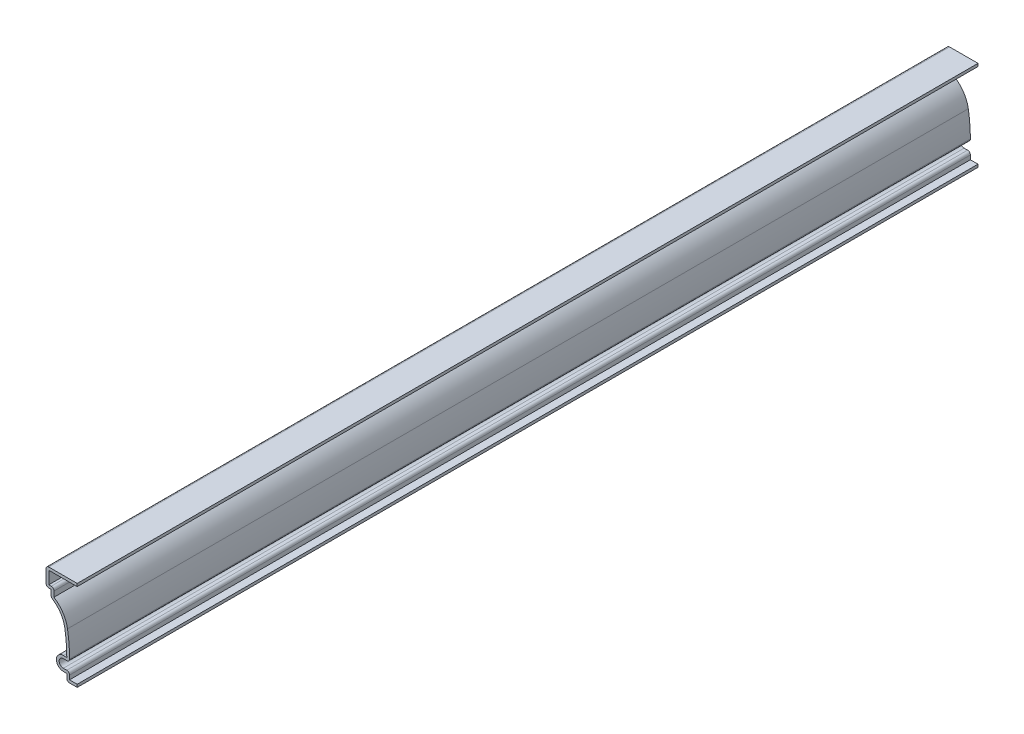
ISO-10303-21;
HEADER;
FILE_DESCRIPTION(('STEP AP214'),'2;1');
FILE_NAME('part.step','',(''),(''),'','','');
FILE_SCHEMA(('AUTOMOTIVE_DESIGN { 1 0 10303 214 1 1 1 1 }'));
ENDSEC;
DATA;
#1=APPLICATION_CONTEXT('core data for automotive mechanical design processes');
#2=APPLICATION_PROTOCOL_DEFINITION('international standard','automotive_design',2000,#1);
#3=PRODUCT_CONTEXT('',#1,'mechanical');
#4=PRODUCT('Part','Part','',(#3));
#5=PRODUCT_RELATED_PRODUCT_CATEGORY('part','',(#4));
#6=PRODUCT_DEFINITION_FORMATION('','',#4);
#7=PRODUCT_DEFINITION_CONTEXT('part definition',#1,'design');
#8=PRODUCT_DEFINITION('design','',#6,#7);
#9=PRODUCT_DEFINITION_SHAPE('','',#8);
#10=(LENGTH_UNIT() NAMED_UNIT(*) SI_UNIT(.MILLI.,.METRE.));
#11=(NAMED_UNIT(*) PLANE_ANGLE_UNIT() SI_UNIT($,.RADIAN.));
#12=(NAMED_UNIT(*) SI_UNIT($,.STERADIAN.) SOLID_ANGLE_UNIT());
#13=UNCERTAINTY_MEASURE_WITH_UNIT(LENGTH_MEASURE(1.E-05),#10,'distance_accuracy_value','');
#14=(GEOMETRIC_REPRESENTATION_CONTEXT(3) GLOBAL_UNCERTAINTY_ASSIGNED_CONTEXT((#13)) GLOBAL_UNIT_ASSIGNED_CONTEXT((#10,
#11,#12)) REPRESENTATION_CONTEXT('',''));
#15=CARTESIAN_POINT('',(0.,0.,0.));
#16=DIRECTION('',(0.,0.,1.));
#17=DIRECTION('',(1.,0.,0.));
#18=AXIS2_PLACEMENT_3D('',#15,#16,#17);
#19=CARTESIAN_POINT('',(0.,0.,-412.75));
#20=DIRECTION('',(0.,-1.,0.));
#21=DIRECTION('',(1.,0.,0.));
#22=AXIS2_PLACEMENT_3D('',#19,#20,#21);
#23=PLANE('',#22);
#24=DIRECTION('',(1.,0.,0.));
#25=VECTOR('',#24,1.);
#26=CARTESIAN_POINT('',(0.,0.,0.));
#27=LINE('',#26,#25);
#28=CARTESIAN_POINT('',(-3.4925,0.,0.));
#29=VERTEX_POINT('',#28);
#30=CARTESIAN_POINT('',(0.,0.,0.));
#31=VERTEX_POINT('',#30);
#32=EDGE_CURVE('E443',#29,#31,#27,.T.);
#33=ORIENTED_EDGE('',*,*,#32,.F.);
#34=DIRECTION('',(0.,0.,1.));
#35=VECTOR('',#34,1.);
#36=CARTESIAN_POINT('',(-3.4925,0.,-412.75));
#37=LINE('',#36,#35);
#38=CARTESIAN_POINT('',(-3.4925,0.,-412.75));
#39=VERTEX_POINT('',#38);
#40=EDGE_CURVE('E247',#29,#39,#37,.F.);
#41=ORIENTED_EDGE('',*,*,#40,.T.);
#42=DIRECTION('',(1.,0.,0.));
#43=VECTOR('',#42,1.);
#44=CARTESIAN_POINT('',(0.,0.,-412.75));
#45=LINE('',#44,#43);
#46=CARTESIAN_POINT('',(0.,0.,-412.75));
#47=VERTEX_POINT('',#46);
#48=EDGE_CURVE('E240',#39,#47,#45,.T.);
#49=ORIENTED_EDGE('',*,*,#48,.T.);
#50=DIRECTION('',(0.,0.,1.));
#51=VECTOR('',#50,1.);
#52=CARTESIAN_POINT('',(0.,0.,-412.75));
#53=LINE('',#52,#51);
#54=EDGE_CURVE('E244',#47,#31,#53,.T.);
#55=ORIENTED_EDGE('',*,*,#54,.T.);
#56=EDGE_LOOP('',(#33,#41,#49,#55));
#57=FACE_BOUND('',#56,.T.);
#58=ADVANCED_FACE('F35',(#57),#23,.T.);
#59=CARTESIAN_POINT('',(-4.7625,0.,-412.75));
#60=DIRECTION('',(-1.,0.,0.));
#61=DIRECTION('',(0.,0.,1.));
#62=AXIS2_PLACEMENT_3D('',#59,#60,#61);
#63=PLANE('',#62);
#64=DIRECTION('',(0.,-1.,0.));
#65=VECTOR('',#64,1.);
#66=CARTESIAN_POINT('',(-4.7625,0.,-412.75));
#67=LINE('',#66,#65);
#68=CARTESIAN_POINT('',(-4.7625,3.175,-412.75));
#69=VERTEX_POINT('',#68);
#70=CARTESIAN_POINT('',(-4.7625,1.27,-412.75));
#71=VERTEX_POINT('',#70);
#72=EDGE_CURVE('E264',#69,#71,#67,.T.);
#73=ORIENTED_EDGE('',*,*,#72,.T.);
#74=DIRECTION('',(0.,0.,1.));
#75=VECTOR('',#74,1.);
#76=CARTESIAN_POINT('',(-4.7625,1.27,-412.75));
#77=LINE('',#76,#75);
#78=CARTESIAN_POINT('',(-4.7625,1.27,0.));
#79=VERTEX_POINT('',#78);
#80=EDGE_CURVE('E273',#71,#79,#77,.T.);
#81=ORIENTED_EDGE('',*,*,#80,.T.);
#82=DIRECTION('',(0.,-1.,0.));
#83=VECTOR('',#82,1.);
#84=CARTESIAN_POINT('',(-4.7625,0.,0.));
#85=LINE('',#84,#83);
#86=CARTESIAN_POINT('',(-4.7625,3.175,0.));
#87=VERTEX_POINT('',#86);
#88=EDGE_CURVE('E250',#87,#79,#85,.T.);
#89=ORIENTED_EDGE('',*,*,#88,.F.);
#90=DIRECTION('',(0.,0.,1.));
#91=VECTOR('',#90,1.);
#92=CARTESIAN_POINT('',(-4.7625,3.175,-412.75));
#93=LINE('',#92,#91);
#94=EDGE_CURVE('E277',#69,#87,#93,.T.);
#95=ORIENTED_EDGE('',*,*,#94,.F.);
#96=EDGE_LOOP('',(#73,#81,#89,#95));
#97=FACE_BOUND('',#96,.T.);
#98=ADVANCED_FACE('F514',(#97),#63,.T.);
#99=CARTESIAN_POINT('',(-4.7625,3.175,-412.75));
#100=DIRECTION('',(0.,-1.,0.));
#101=DIRECTION('',(0.,0.,-1.));
#102=AXIS2_PLACEMENT_3D('',#99,#100,#101);
#103=PLANE('',#102);
#104=DIRECTION('',(1.,0.,0.));
#105=VECTOR('',#104,1.);
#106=CARTESIAN_POINT('',(-4.7625,3.175,0.));
#107=LINE('',#106,#105);
#108=CARTESIAN_POINT('',(-6.35,3.175,0.));
#109=VERTEX_POINT('',#108);
#110=EDGE_CURVE('E394',#109,#87,#107,.T.);
#111=ORIENTED_EDGE('',*,*,#110,.F.);
#112=DIRECTION('',(0.,0.,1.));
#113=VECTOR('',#112,1.);
#114=CARTESIAN_POINT('',(-6.35,3.175,-412.75));
#115=LINE('',#114,#113);
#116=CARTESIAN_POINT('',(-6.35,3.175,-412.75));
#117=VERTEX_POINT('',#116);
#118=EDGE_CURVE('E399',#117,#109,#115,.T.);
#119=ORIENTED_EDGE('',*,*,#118,.F.);
#120=DIRECTION('',(1.,0.,0.));
#121=VECTOR('',#120,1.);
#122=CARTESIAN_POINT('',(-4.7625,3.175,-412.75));
#123=LINE('',#122,#121);
#124=EDGE_CURVE('E269',#117,#69,#123,.T.);
#125=ORIENTED_EDGE('',*,*,#124,.T.);
#126=ORIENTED_EDGE('',*,*,#94,.T.);
#127=EDGE_LOOP('',(#111,#119,#125,#126));
#128=FACE_BOUND('',#127,.T.);
#129=ADVANCED_FACE('F518',(#128),#103,.T.);
#130=CARTESIAN_POINT('',(-6.35,6.35,-412.75));
#131=DIRECTION('',(0.,0.,1.));
#132=DIRECTION('',(1.,0.,0.));
#133=AXIS2_PLACEMENT_3D('',#130,#131,#132);
#134=CYLINDRICAL_SURFACE('',#133,3.175);
#135=CARTESIAN_POINT('',(-6.35,6.35,0.));
#136=DIRECTION('',(0.,0.,1.));
#137=DIRECTION('',(-1.,0.,0.));
#138=AXIS2_PLACEMENT_3D('',#135,#136,#137);
#139=CIRCLE('',#138,3.175);
#140=CARTESIAN_POINT('',(-6.35,9.525,0.));
#141=VERTEX_POINT('',#140);
#142=EDGE_CURVE('E391',#141,#109,#139,.T.);
#143=ORIENTED_EDGE('',*,*,#142,.F.);
#144=DIRECTION('',(0.,0.,1.));
#145=VECTOR('',#144,1.);
#146=CARTESIAN_POINT('',(-6.35,9.525,-412.75));
#147=LINE('',#146,#145);
#148=CARTESIAN_POINT('',(-6.35,9.525,-412.75));
#149=VERTEX_POINT('',#148);
#150=EDGE_CURVE('E401',#149,#141,#147,.T.);
#151=ORIENTED_EDGE('',*,*,#150,.F.);
#152=CARTESIAN_POINT('',(-6.35,6.35,-412.75));
#153=DIRECTION('',(0.,0.,1.));
#154=DIRECTION('',(-1.,0.,0.));
#155=AXIS2_PLACEMENT_3D('',#152,#153,#154);
#156=CIRCLE('',#155,3.175);
#157=EDGE_CURVE('E504',#149,#117,#156,.T.);
#158=ORIENTED_EDGE('',*,*,#157,.T.);
#159=ORIENTED_EDGE('',*,*,#118,.T.);
#160=EDGE_LOOP('',(#143,#151,#158,#159));
#161=FACE_BOUND('',#160,.T.);
#162=ADVANCED_FACE('F523',(#161),#134,.T.);
#163=CARTESIAN_POINT('',(-6.35,9.525,-412.75));
#164=DIRECTION('',(0.,1.,0.));
#165=DIRECTION('',(-1.,0.,0.));
#166=AXIS2_PLACEMENT_3D('',#163,#164,#165);
#167=PLANE('',#166);
#168=DIRECTION('',(-1.,0.,0.));
#169=VECTOR('',#168,1.);
#170=CARTESIAN_POINT('',(-6.35,9.525,0.));
#171=LINE('',#170,#169);
#172=CARTESIAN_POINT('',(-4.7625,9.525,0.));
#173=VERTEX_POINT('',#172);
#174=EDGE_CURVE('E388',#173,#141,#171,.T.);
#175=ORIENTED_EDGE('',*,*,#174,.F.);
#176=DIRECTION('',(0.,0.,1.));
#177=VECTOR('',#176,1.);
#178=CARTESIAN_POINT('',(-4.7625,9.525,-412.75));
#179=LINE('',#178,#177);
#180=CARTESIAN_POINT('',(-4.7625,9.525,-412.75));
#181=VERTEX_POINT('',#180);
#182=EDGE_CURVE('E403',#181,#173,#179,.T.);
#183=ORIENTED_EDGE('',*,*,#182,.F.);
#184=DIRECTION('',(-1.,0.,0.));
#185=VECTOR('',#184,1.);
#186=CARTESIAN_POINT('',(-6.35,9.525,-412.75));
#187=LINE('',#186,#185);
#188=EDGE_CURVE('E501',#181,#149,#187,.T.);
#189=ORIENTED_EDGE('',*,*,#188,.T.);
#190=ORIENTED_EDGE('',*,*,#150,.T.);
#191=EDGE_LOOP('',(#175,#183,#189,#190));
#192=FACE_BOUND('',#191,.T.);
#193=ADVANCED_FACE('F526',(#192),#167,.T.);
#194=CARTESIAN_POINT('',(-73.81875,9.525,-412.75));
#195=DIRECTION('',(0.,0.,1.));
#196=DIRECTION('',(1.,0.,0.));
#197=AXIS2_PLACEMENT_3D('',#194,#195,#196);
#198=CYLINDRICAL_SURFACE('',#197,69.05625);
#199=CARTESIAN_POINT('',(-73.81875,9.525,0.));
#200=DIRECTION('',(0.,0.,-1.));
#201=DIRECTION('',(-1.,0.,0.));
#202=AXIS2_PLACEMENT_3D('',#199,#200,#201);
#203=CIRCLE('',#202,69.05625);
#204=CARTESIAN_POINT('',(-5.69345136267402,20.8258561462241,0.));
#205=VERTEX_POINT('',#204);
#206=EDGE_CURVE('E385',#205,#173,#203,.T.);
#207=ORIENTED_EDGE('',*,*,#206,.F.);
#208=DIRECTION('',(0.,0.,1.));
#209=VECTOR('',#208,1.);
#210=CARTESIAN_POINT('',(-5.69345136267402,20.8258561462241,-412.75));
#211=LINE('',#210,#209);
#212=CARTESIAN_POINT('',(-5.69345136267402,20.8258561462241,-412.75));
#213=VERTEX_POINT('',#212);
#214=EDGE_CURVE('E405',#213,#205,#211,.T.);
#215=ORIENTED_EDGE('',*,*,#214,.F.);
#216=CARTESIAN_POINT('',(-73.81875,9.525,-412.75));
#217=DIRECTION('',(0.,0.,-1.));
#218=DIRECTION('',(-1.,0.,0.));
#219=AXIS2_PLACEMENT_3D('',#216,#217,#218);
#220=CIRCLE('',#219,69.05625);
#221=EDGE_CURVE('E498',#213,#181,#220,.T.);
#222=ORIENTED_EDGE('',*,*,#221,.T.);
#223=ORIENTED_EDGE('',*,*,#182,.T.);
#224=EDGE_LOOP('',(#207,#215,#222,#223));
#225=FACE_BOUND('',#224,.T.);
#226=ADVANCED_FACE('F532',(#225),#198,.F.);
#227=CARTESIAN_POINT('',(-18.222241916665,18.7475377745047,-412.75));
#228=DIRECTION('',(0.,0.,1.));
#229=DIRECTION('',(1.,0.,0.));
#230=AXIS2_PLACEMENT_3D('',#227,#228,#229);
#231=CYLINDRICAL_SURFACE('',#230,12.7);
#232=CARTESIAN_POINT('',(-18.222241916665,18.7475377745047,0.));
#233=DIRECTION('',(0.,0.,-1.));
#234=DIRECTION('',(-1.,0.,0.));
#235=AXIS2_PLACEMENT_3D('',#232,#233,#234);
#236=CIRCLE('',#235,12.7);
#237=CARTESIAN_POINT('',(-11.3258856287877,29.4119772792633,0.));
#238=VERTEX_POINT('',#237);
#239=EDGE_CURVE('E383',#238,#205,#236,.T.);
#240=ORIENTED_EDGE('',*,*,#239,.F.);
#241=DIRECTION('',(0.,0.,1.));
#242=VECTOR('',#241,1.);
#243=CARTESIAN_POINT('',(-11.3258856287877,29.4119772792633,-412.75));
#244=LINE('',#243,#242);
#245=CARTESIAN_POINT('',(-11.3258856287877,29.4119772792633,-412.75));
#246=VERTEX_POINT('',#245);
#247=EDGE_CURVE('E317',#238,#246,#244,.F.);
#248=ORIENTED_EDGE('',*,*,#247,.T.);
#249=CARTESIAN_POINT('',(-18.222241916665,18.7475377745047,-412.75));
#250=DIRECTION('',(0.,0.,-1.));
#251=DIRECTION('',(-1.,0.,0.));
#252=AXIS2_PLACEMENT_3D('',#249,#250,#251);
#253=CIRCLE('',#252,12.7);
#254=EDGE_CURVE('E496',#246,#213,#253,.T.);
#255=ORIENTED_EDGE('',*,*,#254,.T.);
#256=ORIENTED_EDGE('',*,*,#214,.T.);
#257=EDGE_LOOP('',(#240,#248,#255,#256));
#258=FACE_BOUND('',#257,.T.);
#259=ADVANCED_FACE('F535',(#258),#231,.F.);
#260=CARTESIAN_POINT('',(-11.90625,32.940625,-412.75));
#261=DIRECTION('',(-1.,0.,0.));
#262=DIRECTION('',(0.,0.,1.));
#263=AXIS2_PLACEMENT_3D('',#260,#261,#262);
#264=PLANE('',#263);
#265=DIRECTION('',(0.,-1.,0.));
#266=VECTOR('',#265,1.);
#267=CARTESIAN_POINT('',(-11.90625,32.940625,-412.75));
#268=LINE('',#267,#266);
#269=CARTESIAN_POINT('',(-11.90625,32.940625,-412.75));
#270=VERTEX_POINT('',#269);
#271=CARTESIAN_POINT('',(-11.90625,30.4784212297392,-412.75));
#272=VERTEX_POINT('',#271);
#273=EDGE_CURVE('E493',#270,#272,#268,.T.);
#274=ORIENTED_EDGE('',*,*,#273,.T.);
#275=DIRECTION('',(0.,0.,1.));
#276=VECTOR('',#275,1.);
#277=CARTESIAN_POINT('',(-11.90625,30.4784212297392,-412.75));
#278=LINE('',#277,#276);
#279=CARTESIAN_POINT('',(-11.90625,30.4784212297392,0.));
#280=VERTEX_POINT('',#279);
#281=EDGE_CURVE('E314',#272,#280,#278,.T.);
#282=ORIENTED_EDGE('',*,*,#281,.T.);
#283=DIRECTION('',(0.,-1.,0.));
#284=VECTOR('',#283,1.);
#285=CARTESIAN_POINT('',(-11.90625,32.940625,0.));
#286=LINE('',#285,#284);
#287=CARTESIAN_POINT('',(-11.90625,32.940625,0.));
#288=VERTEX_POINT('',#287);
#289=EDGE_CURVE('E380',#288,#280,#286,.T.);
#290=ORIENTED_EDGE('',*,*,#289,.F.);
#291=DIRECTION('',(0.,0.,1.));
#292=VECTOR('',#291,1.);
#293=CARTESIAN_POINT('',(-11.90625,32.940625,-412.75));
#294=LINE('',#293,#292);
#295=EDGE_CURVE('E408',#270,#288,#294,.T.);
#296=ORIENTED_EDGE('',*,*,#295,.F.);
#297=EDGE_LOOP('',(#274,#282,#290,#296));
#298=FACE_BOUND('',#297,.T.);
#299=ADVANCED_FACE('F544',(#298),#264,.T.);
#300=CARTESIAN_POINT('',(-14.2875,32.940625,-412.75));
#301=DIRECTION('',(0.,-1.,0.));
#302=DIRECTION('',(1.,0.,0.));
#303=AXIS2_PLACEMENT_3D('',#300,#301,#302);
#304=PLANE('',#303);
#305=DIRECTION('',(1.,0.,0.));
#306=VECTOR('',#305,1.);
#307=CARTESIAN_POINT('',(-14.2875,32.940625,0.));
#308=LINE('',#307,#306);
#309=CARTESIAN_POINT('',(-13.0175,32.940625,0.));
#310=VERTEX_POINT('',#309);
#311=EDGE_CURVE('E378',#310,#288,#308,.T.);
#312=ORIENTED_EDGE('',*,*,#311,.F.);
#313=DIRECTION('',(0.,0.,1.));
#314=VECTOR('',#313,1.);
#315=CARTESIAN_POINT('',(-13.0175,32.940625,-412.75));
#316=LINE('',#315,#314);
#317=CARTESIAN_POINT('',(-13.0175,32.940625,-412.75));
#318=VERTEX_POINT('',#317);
#319=EDGE_CURVE('E324',#310,#318,#316,.F.);
#320=ORIENTED_EDGE('',*,*,#319,.T.);
#321=DIRECTION('',(1.,0.,0.));
#322=VECTOR('',#321,1.);
#323=CARTESIAN_POINT('',(-14.2875,32.940625,-412.75));
#324=LINE('',#323,#322);
#325=EDGE_CURVE('E491',#318,#270,#324,.T.);
#326=ORIENTED_EDGE('',*,*,#325,.T.);
#327=ORIENTED_EDGE('',*,*,#295,.T.);
#328=EDGE_LOOP('',(#312,#320,#326,#327));
#329=FACE_BOUND('',#328,.T.);
#330=ADVANCED_FACE('F549',(#329),#304,.T.);
#331=CARTESIAN_POINT('',(-14.2875,41.275,-412.75));
#332=DIRECTION('',(-1.,0.,0.));
#333=DIRECTION('',(0.,-1.,0.));
#334=AXIS2_PLACEMENT_3D('',#331,#332,#333);
#335=PLANE('',#334);
#336=DIRECTION('',(0.,-1.,0.));
#337=VECTOR('',#336,1.);
#338=CARTESIAN_POINT('',(-14.2875,41.275,-412.75));
#339=LINE('',#338,#337);
#340=CARTESIAN_POINT('',(-14.2875,40.005,-412.75));
#341=VERTEX_POINT('',#340);
#342=CARTESIAN_POINT('',(-14.2875,34.210625,-412.75));
#343=VERTEX_POINT('',#342);
#344=EDGE_CURVE('E488',#341,#343,#339,.T.);
#345=ORIENTED_EDGE('',*,*,#344,.T.);
#346=DIRECTION('',(0.,0.,1.));
#347=VECTOR('',#346,1.);
#348=CARTESIAN_POINT('',(-14.2875,34.210625,-412.75));
#349=LINE('',#348,#347);
#350=CARTESIAN_POINT('',(-14.2875,34.210625,0.));
#351=VERTEX_POINT('',#350);
#352=EDGE_CURVE('E321',#343,#351,#349,.T.);
#353=ORIENTED_EDGE('',*,*,#352,.T.);
#354=DIRECTION('',(0.,-1.,0.));
#355=VECTOR('',#354,1.);
#356=CARTESIAN_POINT('',(-14.2875,41.275,0.));
#357=LINE('',#356,#355);
#358=CARTESIAN_POINT('',(-14.2875,40.005,0.));
#359=VERTEX_POINT('',#358);
#360=EDGE_CURVE('E375',#359,#351,#357,.T.);
#361=ORIENTED_EDGE('',*,*,#360,.F.);
#362=DIRECTION('',(0.,0.,1.));
#363=VECTOR('',#362,1.);
#364=CARTESIAN_POINT('',(-14.2875,40.005,-412.75));
#365=LINE('',#364,#363);
#366=EDGE_CURVE('E319',#359,#341,#365,.F.);
#367=ORIENTED_EDGE('',*,*,#366,.T.);
#368=EDGE_LOOP('',(#345,#353,#361,#367));
#369=FACE_BOUND('',#368,.T.);
#370=ADVANCED_FACE('F558',(#369),#335,.T.);
#371=CARTESIAN_POINT('',(0.,41.275,-412.75));
#372=DIRECTION('',(0.,1.,0.));
#373=DIRECTION('',(0.,0.,1.));
#374=AXIS2_PLACEMENT_3D('',#371,#372,#373);
#375=PLANE('',#374);
#376=DIRECTION('',(-1.,0.,0.));
#377=VECTOR('',#376,1.);
#378=CARTESIAN_POINT('',(0.,41.275,-412.75));
#379=LINE('',#378,#377);
#380=CARTESIAN_POINT('',(0.,41.275,-412.75));
#381=VERTEX_POINT('',#380);
#382=CARTESIAN_POINT('',(-13.0175,41.275,-412.75));
#383=VERTEX_POINT('',#382);
#384=EDGE_CURVE('E485',#381,#383,#379,.T.);
#385=ORIENTED_EDGE('',*,*,#384,.T.);
#386=DIRECTION('',(0.,0.,1.));
#387=VECTOR('',#386,1.);
#388=CARTESIAN_POINT('',(-13.0175,41.275,-412.75));
#389=LINE('',#388,#387);
#390=CARTESIAN_POINT('',(-13.0175,41.275,0.));
#391=VERTEX_POINT('',#390);
#392=EDGE_CURVE('E11',#383,#391,#389,.T.);
#393=ORIENTED_EDGE('',*,*,#392,.T.);
#394=DIRECTION('',(-1.,0.,0.));
#395=VECTOR('',#394,1.);
#396=CARTESIAN_POINT('',(0.,41.275,0.));
#397=LINE('',#396,#395);
#398=CARTESIAN_POINT('',(0.,41.275,0.));
#399=VERTEX_POINT('',#398);
#400=EDGE_CURVE('E372',#399,#391,#397,.T.);
#401=ORIENTED_EDGE('',*,*,#400,.F.);
#402=DIRECTION('',(0.,0.,1.));
#403=VECTOR('',#402,1.);
#404=CARTESIAN_POINT('',(0.,41.275,-412.75));
#405=LINE('',#404,#403);
#406=EDGE_CURVE('E411',#381,#399,#405,.T.);
#407=ORIENTED_EDGE('',*,*,#406,.F.);
#408=EDGE_LOOP('',(#385,#393,#401,#407));
#409=FACE_BOUND('',#408,.T.);
#410=ADVANCED_FACE('F566',(#409),#375,.T.);
#411=CARTESIAN_POINT('',(0.,41.275,-412.75));
#412=DIRECTION('',(-1.,0.,0.));
#413=DIRECTION('',(0.,0.,1.));
#414=AXIS2_PLACEMENT_3D('',#411,#412,#413);
#415=PLANE('',#414);
#416=DIRECTION('',(0.,-1.,0.));
#417=VECTOR('',#416,1.);
#418=CARTESIAN_POINT('',(0.,41.275,0.));
#419=LINE('',#418,#417);
#420=CARTESIAN_POINT('',(0.,40.005,0.));
#421=VERTEX_POINT('',#420);
#422=EDGE_CURVE('E370',#399,#421,#419,.T.);
#423=ORIENTED_EDGE('',*,*,#422,.T.);
#424=DIRECTION('',(0.,0.,1.));
#425=VECTOR('',#424,1.);
#426=CARTESIAN_POINT('',(0.,40.005,-412.75));
#427=LINE('',#426,#425);
#428=CARTESIAN_POINT('',(0.,40.005,-412.75));
#429=VERTEX_POINT('',#428);
#430=EDGE_CURVE('E413',#429,#421,#427,.T.);
#431=ORIENTED_EDGE('',*,*,#430,.F.);
#432=DIRECTION('',(0.,-1.,0.));
#433=VECTOR('',#432,1.);
#434=CARTESIAN_POINT('',(0.,41.275,-412.75));
#435=LINE('',#434,#433);
#436=EDGE_CURVE('E483',#381,#429,#435,.T.);
#437=ORIENTED_EDGE('',*,*,#436,.F.);
#438=ORIENTED_EDGE('',*,*,#406,.T.);
#439=EDGE_LOOP('',(#423,#431,#437,#438));
#440=FACE_BOUND('',#439,.T.);
#441=ADVANCED_FACE('F573',(#440),#415,.F.);
#442=CARTESIAN_POINT('',(0.,40.005,-412.75));
#443=DIRECTION('',(0.,1.,0.));
#444=DIRECTION('',(0.,0.,1.));
#445=AXIS2_PLACEMENT_3D('',#442,#443,#444);
#446=PLANE('',#445);
#447=DIRECTION('',(1.,0.,0.));
#448=VECTOR('',#447,1.);
#449=CARTESIAN_POINT('',(0.,40.005,0.));
#450=LINE('',#449,#448);
#451=CARTESIAN_POINT('',(-13.0175,40.005,0.));
#452=VERTEX_POINT('',#451);
#453=EDGE_CURVE('E368',#421,#452,#450,.F.);
#454=ORIENTED_EDGE('',*,*,#453,.T.);
#455=DIRECTION('',(0.,0.,1.));
#456=VECTOR('',#455,1.);
#457=CARTESIAN_POINT('',(-13.0175,40.005,-412.75));
#458=LINE('',#457,#456);
#459=CARTESIAN_POINT('',(-13.0175,40.005,-412.75));
#460=VERTEX_POINT('',#459);
#461=EDGE_CURVE('E416',#460,#452,#458,.T.);
#462=ORIENTED_EDGE('',*,*,#461,.F.);
#463=DIRECTION('',(1.,0.,0.));
#464=VECTOR('',#463,1.);
#465=CARTESIAN_POINT('',(0.,40.005,-412.75));
#466=LINE('',#465,#464);
#467=EDGE_CURVE('E481',#429,#460,#466,.F.);
#468=ORIENTED_EDGE('',*,*,#467,.F.);
#469=ORIENTED_EDGE('',*,*,#430,.T.);
#470=EDGE_LOOP('',(#454,#462,#468,#469));
#471=FACE_BOUND('',#470,.T.);
#472=ADVANCED_FACE('F576',(#471),#446,.F.);
#473=CARTESIAN_POINT('',(-13.0175,41.275,-412.75));
#474=DIRECTION('',(-1.,0.,0.));
#475=DIRECTION('',(0.,-1.,0.));
#476=AXIS2_PLACEMENT_3D('',#473,#474,#475);
#477=PLANE('',#476);
#478=DIRECTION('',(0.,-1.,0.));
#479=VECTOR('',#478,1.);
#480=CARTESIAN_POINT('',(-13.0175,41.275,0.));
#481=LINE('',#480,#479);
#482=CARTESIAN_POINT('',(-13.0175,34.210625,0.));
#483=VERTEX_POINT('',#482);
#484=EDGE_CURVE('E361',#452,#483,#481,.T.);
#485=ORIENTED_EDGE('',*,*,#484,.T.);
#486=DIRECTION('',(0.,0.,1.));
#487=VECTOR('',#486,1.);
#488=CARTESIAN_POINT('',(-13.0175,34.210625,-412.75));
#489=LINE('',#488,#487);
#490=CARTESIAN_POINT('',(-13.0175,34.210625,-412.75));
#491=VERTEX_POINT('',#490);
#492=EDGE_CURVE('E419',#491,#483,#489,.T.);
#493=ORIENTED_EDGE('',*,*,#492,.F.);
#494=DIRECTION('',(0.,-1.,0.));
#495=VECTOR('',#494,1.);
#496=CARTESIAN_POINT('',(-13.0175,41.275,-412.75));
#497=LINE('',#496,#495);
#498=EDGE_CURVE('E342',#460,#491,#497,.T.);
#499=ORIENTED_EDGE('',*,*,#498,.F.);
#500=ORIENTED_EDGE('',*,*,#461,.T.);
#501=EDGE_LOOP('',(#485,#493,#499,#500));
#502=FACE_BOUND('',#501,.T.);
#503=ADVANCED_FACE('F579',(#502),#477,.F.);
#504=CARTESIAN_POINT('',(-14.2875,34.210625,-412.75));
#505=DIRECTION('',(0.,-1.,0.));
#506=DIRECTION('',(1.,0.,0.));
#507=AXIS2_PLACEMENT_3D('',#504,#505,#506);
#508=PLANE('',#507);
#509=DIRECTION('',(1.,0.,0.));
#510=VECTOR('',#509,1.);
#511=CARTESIAN_POINT('',(-14.2875,34.210625,0.));
#512=LINE('',#511,#510);
#513=CARTESIAN_POINT('',(-11.90625,34.210625,0.));
#514=VERTEX_POINT('',#513);
#515=EDGE_CURVE('E337',#483,#514,#512,.T.);
#516=ORIENTED_EDGE('',*,*,#515,.T.);
#517=DIRECTION('',(0.,0.,1.));
#518=VECTOR('',#517,1.);
#519=CARTESIAN_POINT('',(-11.90625,34.210625,-412.75));
#520=LINE('',#519,#518);
#521=CARTESIAN_POINT('',(-11.90625,34.210625,-412.75));
#522=VERTEX_POINT('',#521);
#523=EDGE_CURVE('E43',#514,#522,#520,.F.);
#524=ORIENTED_EDGE('',*,*,#523,.T.);
#525=DIRECTION('',(1.,0.,0.));
#526=VECTOR('',#525,1.);
#527=CARTESIAN_POINT('',(-14.2875,34.210625,-412.75));
#528=LINE('',#527,#526);
#529=EDGE_CURVE('E335',#491,#522,#528,.T.);
#530=ORIENTED_EDGE('',*,*,#529,.F.);
#531=ORIENTED_EDGE('',*,*,#492,.T.);
#532=EDGE_LOOP('',(#516,#524,#530,#531));
#533=FACE_BOUND('',#532,.T.);
#534=ADVANCED_FACE('F333',(#533),#508,.F.);
#535=CARTESIAN_POINT('',(-10.63625,32.940625,-412.75));
#536=DIRECTION('',(-1.,0.,0.));
#537=DIRECTION('',(0.,0.,1.));
#538=AXIS2_PLACEMENT_3D('',#535,#536,#537);
#539=PLANE('',#538);
#540=DIRECTION('',(0.,1.,0.));
#541=VECTOR('',#540,1.);
#542=CARTESIAN_POINT('',(-10.63625,32.940625,-412.75));
#543=LINE('',#542,#541);
#544=CARTESIAN_POINT('',(-10.63625,32.940625,-412.75));
#545=VERTEX_POINT('',#544);
#546=CARTESIAN_POINT('',(-10.63625,30.4784212297392,-412.75));
#547=VERTEX_POINT('',#546);
#548=EDGE_CURVE('E344',#545,#547,#543,.F.);
#549=ORIENTED_EDGE('',*,*,#548,.F.);
#550=DIRECTION('',(0.,0.,1.));
#551=VECTOR('',#550,1.);
#552=CARTESIAN_POINT('',(-10.63625,32.940625,-412.75));
#553=LINE('',#552,#551);
#554=CARTESIAN_POINT('',(-10.63625,32.940625,0.));
#555=VERTEX_POINT('',#554);
#556=EDGE_CURVE('E326',#545,#555,#553,.T.);
#557=ORIENTED_EDGE('',*,*,#556,.T.);
#558=DIRECTION('',(0.,1.,0.));
#559=VECTOR('',#558,1.);
#560=CARTESIAN_POINT('',(-10.63625,32.940625,0.));
#561=LINE('',#560,#559);
#562=CARTESIAN_POINT('',(-10.63625,30.4784212297392,0.));
#563=VERTEX_POINT('',#562);
#564=EDGE_CURVE('E352',#555,#563,#561,.F.);
#565=ORIENTED_EDGE('',*,*,#564,.T.);
#566=DIRECTION('',(0.,0.,1.));
#567=VECTOR('',#566,1.);
#568=CARTESIAN_POINT('',(-10.63625,30.4784212297392,-412.75));
#569=LINE('',#568,#567);
#570=EDGE_CURVE('E421',#547,#563,#569,.T.);
#571=ORIENTED_EDGE('',*,*,#570,.F.);
#572=EDGE_LOOP('',(#549,#557,#565,#571));
#573=FACE_BOUND('',#572,.T.);
#574=ADVANCED_FACE('F350',(#573),#539,.F.);
#575=CARTESIAN_POINT('',(-18.222241916665,18.7475377745047,-412.75));
#576=DIRECTION('',(0.,0.,1.));
#577=DIRECTION('',(1.,0.,0.));
#578=AXIS2_PLACEMENT_3D('',#575,#576,#577);
#579=CYLINDRICAL_SURFACE('',#578,13.97);
#580=CARTESIAN_POINT('',(-18.222241916665,18.7475377745047,0.));
#581=DIRECTION('',(0.,0.,1.));
#582=DIRECTION('',(1.,0.,0.));
#583=AXIS2_PLACEMENT_3D('',#580,#581,#582);
#584=CIRCLE('',#583,13.97);
#585=CARTESIAN_POINT('',(-4.44057230727493,21.033687983396,0.));
#586=VERTEX_POINT('',#585);
#587=EDGE_CURVE('E359',#563,#586,#584,.F.);
#588=ORIENTED_EDGE('',*,*,#587,.T.);
#589=DIRECTION('',(0.,0.,1.));
#590=VECTOR('',#589,1.);
#591=CARTESIAN_POINT('',(-4.44057230727493,21.033687983396,-412.75));
#592=LINE('',#591,#590);
#593=CARTESIAN_POINT('',(-4.44057230727493,21.033687983396,-412.75));
#594=VERTEX_POINT('',#593);
#595=EDGE_CURVE('E423',#594,#586,#592,.T.);
#596=ORIENTED_EDGE('',*,*,#595,.F.);
#597=CARTESIAN_POINT('',(-18.222241916665,18.7475377745047,-412.75));
#598=DIRECTION('',(0.,0.,1.));
#599=DIRECTION('',(1.,0.,0.));
#600=AXIS2_PLACEMENT_3D('',#597,#598,#599);
#601=CIRCLE('',#600,13.97);
#602=EDGE_CURVE('E472',#547,#594,#601,.F.);
#603=ORIENTED_EDGE('',*,*,#602,.F.);
#604=ORIENTED_EDGE('',*,*,#570,.T.);
#605=EDGE_LOOP('',(#588,#596,#603,#604));
#606=FACE_BOUND('',#605,.T.);
#607=ADVANCED_FACE('F707',(#606),#579,.T.);
#608=CARTESIAN_POINT('',(-73.81875,9.525,-412.75));
#609=DIRECTION('',(0.,0.,1.));
#610=DIRECTION('',(1.,0.,0.));
#611=AXIS2_PLACEMENT_3D('',#608,#609,#610);
#612=CYLINDRICAL_SURFACE('',#611,70.32625);
#613=CARTESIAN_POINT('',(-73.81875,9.525,0.));
#614=DIRECTION('',(0.,0.,1.));
#615=DIRECTION('',(1.,0.,0.));
#616=AXIS2_PLACEMENT_3D('',#613,#614,#615);
#617=CIRCLE('',#616,70.32625);
#618=CARTESIAN_POINT('',(-3.49250000000001,9.525,0.));
#619=VERTEX_POINT('',#618);
#620=EDGE_CURVE('E363',#586,#619,#617,.F.);
#621=ORIENTED_EDGE('',*,*,#620,.T.);
#622=DIRECTION('',(0.,0.,1.));
#623=VECTOR('',#622,1.);
#624=CARTESIAN_POINT('',(-3.49250000000001,9.525,-412.75));
#625=LINE('',#624,#623);
#626=CARTESIAN_POINT('',(-3.49250000000001,9.525,-412.75));
#627=VERTEX_POINT('',#626);
#628=EDGE_CURVE('E312',#619,#627,#625,.F.);
#629=ORIENTED_EDGE('',*,*,#628,.T.);
#630=CARTESIAN_POINT('',(-73.81875,9.525,-412.75));
#631=DIRECTION('',(0.,0.,1.));
#632=DIRECTION('',(1.,0.,0.));
#633=AXIS2_PLACEMENT_3D('',#630,#631,#632);
#634=CIRCLE('',#633,70.32625);
#635=EDGE_CURVE('E465',#594,#627,#634,.F.);
#636=ORIENTED_EDGE('',*,*,#635,.F.);
#637=ORIENTED_EDGE('',*,*,#595,.T.);
#638=EDGE_LOOP('',(#621,#629,#636,#637));
#639=FACE_BOUND('',#638,.T.);
#640=ADVANCED_FACE('F454',(#639),#612,.T.);
#641=CARTESIAN_POINT('',(-6.35,8.255,-412.75));
#642=DIRECTION('',(0.,1.,0.));
#643=DIRECTION('',(-1.,0.,0.));
#644=AXIS2_PLACEMENT_3D('',#641,#642,#643);
#645=PLANE('',#644);
#646=DIRECTION('',(-1.,0.,0.));
#647=VECTOR('',#646,1.);
#648=CARTESIAN_POINT('',(-6.35,8.255,-412.75));
#649=LINE('',#648,#647);
#650=CARTESIAN_POINT('',(-4.7625,8.255,-412.75));
#651=VERTEX_POINT('',#650);
#652=CARTESIAN_POINT('',(-6.35,8.255,-412.75));
#653=VERTEX_POINT('',#652);
#654=EDGE_CURVE('E463',#651,#653,#649,.T.);
#655=ORIENTED_EDGE('',*,*,#654,.F.);
#656=DIRECTION('',(0.,0.,1.));
#657=VECTOR('',#656,1.);
#658=CARTESIAN_POINT('',(-4.7625,8.255,-412.75));
#659=LINE('',#658,#657);
#660=CARTESIAN_POINT('',(-4.7625,8.255,0.));
#661=VERTEX_POINT('',#660);
#662=EDGE_CURVE('E309',#651,#661,#659,.T.);
#663=ORIENTED_EDGE('',*,*,#662,.T.);
#664=DIRECTION('',(-1.,0.,0.));
#665=VECTOR('',#664,1.);
#666=CARTESIAN_POINT('',(-6.35,8.255,0.));
#667=LINE('',#666,#665);
#668=CARTESIAN_POINT('',(-6.35,8.255,0.));
#669=VERTEX_POINT('',#668);
#670=EDGE_CURVE('E450',#661,#669,#667,.T.);
#671=ORIENTED_EDGE('',*,*,#670,.T.);
#672=DIRECTION('',(0.,0.,1.));
#673=VECTOR('',#672,1.);
#674=CARTESIAN_POINT('',(-6.35,8.255,-412.75));
#675=LINE('',#674,#673);
#676=EDGE_CURVE('E426',#653,#669,#675,.T.);
#677=ORIENTED_EDGE('',*,*,#676,.F.);
#678=EDGE_LOOP('',(#655,#663,#671,#677));
#679=FACE_BOUND('',#678,.T.);
#680=ADVANCED_FACE('F467',(#679),#645,.F.);
#681=CARTESIAN_POINT('',(-6.35,6.35,-412.75));
#682=DIRECTION('',(0.,0.,1.));
#683=DIRECTION('',(1.,0.,0.));
#684=AXIS2_PLACEMENT_3D('',#681,#682,#683);
#685=CYLINDRICAL_SURFACE('',#684,1.905);
#686=CARTESIAN_POINT('',(-6.35,6.35,0.));
#687=DIRECTION('',(0.,0.,1.));
#688=DIRECTION('',(1.,0.,0.));
#689=AXIS2_PLACEMENT_3D('',#686,#687,#688);
#690=CIRCLE('',#689,1.905);
#691=CARTESIAN_POINT('',(-6.35,4.445,0.));
#692=VERTEX_POINT('',#691);
#693=EDGE_CURVE('E448',#669,#692,#690,.T.);
#694=ORIENTED_EDGE('',*,*,#693,.T.);
#695=DIRECTION('',(0.,0.,1.));
#696=VECTOR('',#695,1.);
#697=CARTESIAN_POINT('',(-6.35,4.445,-412.75));
#698=LINE('',#697,#696);
#699=CARTESIAN_POINT('',(-6.35,4.445,-412.75));
#700=VERTEX_POINT('',#699);
#701=EDGE_CURVE('E429',#700,#692,#698,.T.);
#702=ORIENTED_EDGE('',*,*,#701,.F.);
#703=CARTESIAN_POINT('',(-6.35,6.35,-412.75));
#704=DIRECTION('',(0.,0.,1.));
#705=DIRECTION('',(1.,0.,0.));
#706=AXIS2_PLACEMENT_3D('',#703,#704,#705);
#707=CIRCLE('',#706,1.905);
#708=EDGE_CURVE('E470',#653,#700,#707,.T.);
#709=ORIENTED_EDGE('',*,*,#708,.F.);
#710=ORIENTED_EDGE('',*,*,#676,.T.);
#711=EDGE_LOOP('',(#694,#702,#709,#710));
#712=FACE_BOUND('',#711,.T.);
#713=ADVANCED_FACE('F688',(#712),#685,.F.);
#714=CARTESIAN_POINT('',(-4.7625,4.445,-412.75));
#715=DIRECTION('',(0.,-1.,0.));
#716=DIRECTION('',(0.,0.,-1.));
#717=AXIS2_PLACEMENT_3D('',#714,#715,#716);
#718=PLANE('',#717);
#719=DIRECTION('',(1.,0.,0.));
#720=VECTOR('',#719,1.);
#721=CARTESIAN_POINT('',(-4.7625,4.445,0.));
#722=LINE('',#721,#720);
#723=CARTESIAN_POINT('',(-4.7625,4.445,0.));
#724=VERTEX_POINT('',#723);
#725=EDGE_CURVE('E441',#692,#724,#722,.T.);
#726=ORIENTED_EDGE('',*,*,#725,.T.);
#727=DIRECTION('',(0.,0.,1.));
#728=VECTOR('',#727,1.);
#729=CARTESIAN_POINT('',(-4.7625,4.445,-412.75));
#730=LINE('',#729,#728);
#731=CARTESIAN_POINT('',(-4.7625,4.445,-412.75));
#732=VERTEX_POINT('',#731);
#733=EDGE_CURVE('E58',#724,#732,#730,.F.);
#734=ORIENTED_EDGE('',*,*,#733,.T.);
#735=DIRECTION('',(1.,0.,0.));
#736=VECTOR('',#735,1.);
#737=CARTESIAN_POINT('',(-4.7625,4.445,-412.75));
#738=LINE('',#737,#736);
#739=EDGE_CURVE('E474',#700,#732,#738,.T.);
#740=ORIENTED_EDGE('',*,*,#739,.F.);
#741=ORIENTED_EDGE('',*,*,#701,.T.);
#742=EDGE_LOOP('',(#726,#734,#740,#741));
#743=FACE_BOUND('',#742,.T.);
#744=ADVANCED_FACE('F677',(#743),#718,.F.);
#745=CARTESIAN_POINT('',(-3.4925,0.,-412.75));
#746=DIRECTION('',(-1.,0.,0.));
#747=DIRECTION('',(0.,0.,1.));
#748=AXIS2_PLACEMENT_3D('',#745,#746,#747);
#749=PLANE('',#748);
#750=DIRECTION('',(0.,1.,0.));
#751=VECTOR('',#750,1.);
#752=CARTESIAN_POINT('',(-3.4925,0.,-412.75));
#753=LINE('',#752,#751);
#754=CARTESIAN_POINT('',(-3.4925,3.175,-412.75));
#755=VERTEX_POINT('',#754);
#756=CARTESIAN_POINT('',(-3.4925,1.27,-412.75));
#757=VERTEX_POINT('',#756);
#758=EDGE_CURVE('E856',#755,#757,#753,.F.);
#759=ORIENTED_EDGE('',*,*,#758,.F.);
#760=DIRECTION('',(0.,0.,1.));
#761=VECTOR('',#760,1.);
#762=CARTESIAN_POINT('',(-3.4925,3.175,-412.75));
#763=LINE('',#762,#761);
#764=CARTESIAN_POINT('',(-3.4925,3.175,0.));
#765=VERTEX_POINT('',#764);
#766=EDGE_CURVE('E305',#755,#765,#763,.T.);
#767=ORIENTED_EDGE('',*,*,#766,.T.);
#768=DIRECTION('',(0.,1.,0.));
#769=VECTOR('',#768,1.);
#770=CARTESIAN_POINT('',(-3.4925,0.,0.));
#771=LINE('',#770,#769);
#772=CARTESIAN_POINT('',(-3.4925,1.27,0.));
#773=VERTEX_POINT('',#772);
#774=EDGE_CURVE('E439',#765,#773,#771,.F.);
#775=ORIENTED_EDGE('',*,*,#774,.T.);
#776=DIRECTION('',(0.,0.,1.));
#777=VECTOR('',#776,1.);
#778=CARTESIAN_POINT('',(-3.4925,1.27,-412.75));
#779=LINE('',#778,#777);
#780=EDGE_CURVE('E266',#757,#773,#779,.T.);
#781=ORIENTED_EDGE('',*,*,#780,.F.);
#782=EDGE_LOOP('',(#759,#767,#775,#781));
#783=FACE_BOUND('',#782,.T.);
#784=ADVANCED_FACE('F672',(#783),#749,.F.);
#785=CARTESIAN_POINT('',(0.,1.27,-412.75));
#786=DIRECTION('',(0.,-1.,0.));
#787=DIRECTION('',(1.,0.,0.));
#788=AXIS2_PLACEMENT_3D('',#785,#786,#787);
#789=PLANE('',#788);
#790=DIRECTION('',(1.,0.,0.));
#791=VECTOR('',#790,1.);
#792=CARTESIAN_POINT('',(0.,1.27,0.));
#793=LINE('',#792,#791);
#794=CARTESIAN_POINT('',(0.,1.27,0.));
#795=VERTEX_POINT('',#794);
#796=EDGE_CURVE('E436',#773,#795,#793,.T.);
#797=ORIENTED_EDGE('',*,*,#796,.T.);
#798=DIRECTION('',(0.,0.,1.));
#799=VECTOR('',#798,1.);
#800=CARTESIAN_POINT('',(0.,1.27,-412.75));
#801=LINE('',#800,#799);
#802=CARTESIAN_POINT('',(0.,1.27,-412.75));
#803=VERTEX_POINT('',#802);
#804=EDGE_CURVE('E263',#803,#795,#801,.T.);
#805=ORIENTED_EDGE('',*,*,#804,.F.);
#806=DIRECTION('',(1.,0.,0.));
#807=VECTOR('',#806,1.);
#808=CARTESIAN_POINT('',(0.,1.27,-412.75));
#809=LINE('',#808,#807);
#810=EDGE_CURVE('E255',#757,#803,#809,.T.);
#811=ORIENTED_EDGE('',*,*,#810,.F.);
#812=ORIENTED_EDGE('',*,*,#780,.T.);
#813=EDGE_LOOP('',(#797,#805,#811,#812));
#814=FACE_BOUND('',#813,.T.);
#815=ADVANCED_FACE('F435',(#814),#789,.F.);
#816=CARTESIAN_POINT('',(0.,1.27,-412.75));
#817=DIRECTION('',(-1.,0.,0.));
#818=DIRECTION('',(0.,-1.,0.));
#819=AXIS2_PLACEMENT_3D('',#816,#817,#818);
#820=PLANE('',#819);
#821=DIRECTION('',(0.,-1.,0.));
#822=VECTOR('',#821,1.);
#823=CARTESIAN_POINT('',(0.,1.27,0.));
#824=LINE('',#823,#822);
#825=EDGE_CURVE('E262',#795,#31,#824,.T.);
#826=ORIENTED_EDGE('',*,*,#825,.T.);
#827=ORIENTED_EDGE('',*,*,#54,.F.);
#828=DIRECTION('',(0.,-1.,0.));
#829=VECTOR('',#828,1.);
#830=CARTESIAN_POINT('',(0.,1.27,-412.75));
#831=LINE('',#830,#829);
#832=EDGE_CURVE('E249',#803,#47,#831,.T.);
#833=ORIENTED_EDGE('',*,*,#832,.F.);
#834=ORIENTED_EDGE('',*,*,#804,.T.);
#835=EDGE_LOOP('',(#826,#827,#833,#834));
#836=FACE_BOUND('',#835,.T.);
#837=ADVANCED_FACE('F260',(#836),#820,.F.);
#838=CARTESIAN_POINT('',(-6.35,6.35,-412.75));
#839=DIRECTION('',(0.,0.,1.));
#840=DIRECTION('',(1.,0.,0.));
#841=AXIS2_PLACEMENT_3D('',#838,#839,#840);
#842=PLANE('',#841);
#843=ORIENTED_EDGE('',*,*,#48,.F.);
#844=CARTESIAN_POINT('',(-3.4925,1.27,-412.75));
#845=DIRECTION('',(0.,0.,1.));
#846=DIRECTION('',(1.,0.,0.));
#847=AXIS2_PLACEMENT_3D('',#844,#845,#846);
#848=CIRCLE('',#847,1.27);
#849=EDGE_CURVE('E303',#39,#71,#848,.F.);
#850=ORIENTED_EDGE('',*,*,#849,.T.);
#851=ORIENTED_EDGE('',*,*,#72,.F.);
#852=ORIENTED_EDGE('',*,*,#124,.F.);
#853=ORIENTED_EDGE('',*,*,#157,.F.);
#854=ORIENTED_EDGE('',*,*,#188,.F.);
#855=ORIENTED_EDGE('',*,*,#221,.F.);
#856=ORIENTED_EDGE('',*,*,#254,.F.);
#857=CARTESIAN_POINT('',(-10.63625,30.4784212297392,-412.75));
#858=DIRECTION('',(0.,0.,1.));
#859=DIRECTION('',(1.,0.,0.));
#860=AXIS2_PLACEMENT_3D('',#857,#858,#859);
#861=CIRCLE('',#860,1.27);
#862=EDGE_CURVE('E298',#246,#272,#861,.F.);
#863=ORIENTED_EDGE('',*,*,#862,.T.);
#864=ORIENTED_EDGE('',*,*,#273,.F.);
#865=ORIENTED_EDGE('',*,*,#325,.F.);
#866=CARTESIAN_POINT('',(-13.0175,34.210625,-412.75));
#867=DIRECTION('',(0.,0.,1.));
#868=DIRECTION('',(1.,0.,0.));
#869=AXIS2_PLACEMENT_3D('',#866,#867,#868);
#870=CIRCLE('',#869,1.27);
#871=EDGE_CURVE('E296',#318,#343,#870,.F.);
#872=ORIENTED_EDGE('',*,*,#871,.T.);
#873=ORIENTED_EDGE('',*,*,#344,.F.);
#874=CARTESIAN_POINT('',(-13.0175,40.005,-412.75));
#875=DIRECTION('',(0.,0.,1.));
#876=DIRECTION('',(1.,0.,0.));
#877=AXIS2_PLACEMENT_3D('',#874,#875,#876);
#878=CIRCLE('',#877,1.27);
#879=EDGE_CURVE('E292',#341,#383,#878,.F.);
#880=ORIENTED_EDGE('',*,*,#879,.T.);
#881=ORIENTED_EDGE('',*,*,#384,.F.);
#882=ORIENTED_EDGE('',*,*,#436,.T.);
#883=ORIENTED_EDGE('',*,*,#467,.T.);
#884=ORIENTED_EDGE('',*,*,#498,.T.);
#885=ORIENTED_EDGE('',*,*,#529,.T.);
#886=CARTESIAN_POINT('',(-11.90625,32.940625,-412.75));
#887=DIRECTION('',(0.,0.,1.));
#888=DIRECTION('',(1.,0.,0.));
#889=AXIS2_PLACEMENT_3D('',#886,#887,#888);
#890=CIRCLE('',#889,1.27);
#891=EDGE_CURVE('E294',#522,#545,#890,.F.);
#892=ORIENTED_EDGE('',*,*,#891,.T.);
#893=ORIENTED_EDGE('',*,*,#548,.T.);
#894=ORIENTED_EDGE('',*,*,#602,.T.);
#895=ORIENTED_EDGE('',*,*,#635,.T.);
#896=CARTESIAN_POINT('',(-4.7625,9.525,-412.75));
#897=DIRECTION('',(0.,0.,1.));
#898=DIRECTION('',(1.,0.,0.));
#899=AXIS2_PLACEMENT_3D('',#896,#897,#898);
#900=CIRCLE('',#899,1.27);
#901=EDGE_CURVE('E300',#627,#651,#900,.F.);
#902=ORIENTED_EDGE('',*,*,#901,.T.);
#903=ORIENTED_EDGE('',*,*,#654,.T.);
#904=ORIENTED_EDGE('',*,*,#708,.T.);
#905=ORIENTED_EDGE('',*,*,#739,.T.);
#906=CARTESIAN_POINT('',(-4.7625,3.175,-412.75));
#907=DIRECTION('',(0.,0.,1.));
#908=DIRECTION('',(1.,0.,0.));
#909=AXIS2_PLACEMENT_3D('',#906,#907,#908);
#910=CIRCLE('',#909,1.27);
#911=EDGE_CURVE('E50',#732,#755,#910,.F.);
#912=ORIENTED_EDGE('',*,*,#911,.T.);
#913=ORIENTED_EDGE('',*,*,#758,.T.);
#914=ORIENTED_EDGE('',*,*,#810,.T.);
#915=ORIENTED_EDGE('',*,*,#832,.T.);
#916=EDGE_LOOP('',(#843,#850,#851,#852,#853,#854,#855,#856,#863,#864,#865,#872,#873,#880,#881,
#882,#883,#884,#885,#892,#893,#894,#895,#902,#903,#904,#905,#912,#913,#914,#915));
#917=FACE_BOUND('',#916,.T.);
#918=ADVANCED_FACE('F253',(#917),#842,.F.);
#919=CARTESIAN_POINT('',(-6.35,6.35,0.));
#920=DIRECTION('',(0.,0.,1.));
#921=DIRECTION('',(1.,0.,0.));
#922=AXIS2_PLACEMENT_3D('',#919,#920,#921);
#923=PLANE('',#922);
#924=ORIENTED_EDGE('',*,*,#88,.T.);
#925=CARTESIAN_POINT('',(-3.4925,1.27,0.));
#926=DIRECTION('',(0.,0.,1.));
#927=DIRECTION('',(1.,0.,0.));
#928=AXIS2_PLACEMENT_3D('',#925,#926,#927);
#929=CIRCLE('',#928,1.27);
#930=EDGE_CURVE('E289',#79,#29,#929,.T.);
#931=ORIENTED_EDGE('',*,*,#930,.T.);
#932=ORIENTED_EDGE('',*,*,#32,.T.);
#933=ORIENTED_EDGE('',*,*,#825,.F.);
#934=ORIENTED_EDGE('',*,*,#796,.F.);
#935=ORIENTED_EDGE('',*,*,#774,.F.);
#936=CARTESIAN_POINT('',(-4.7625,3.175,0.));
#937=DIRECTION('',(0.,0.,1.));
#938=DIRECTION('',(1.,0.,0.));
#939=AXIS2_PLACEMENT_3D('',#936,#937,#938);
#940=CIRCLE('',#939,1.27);
#941=EDGE_CURVE('E287',#765,#724,#940,.T.);
#942=ORIENTED_EDGE('',*,*,#941,.T.);
#943=ORIENTED_EDGE('',*,*,#725,.F.);
#944=ORIENTED_EDGE('',*,*,#693,.F.);
#945=ORIENTED_EDGE('',*,*,#670,.F.);
#946=CARTESIAN_POINT('',(-4.7625,9.525,0.));
#947=DIRECTION('',(0.,0.,1.));
#948=DIRECTION('',(1.,0.,0.));
#949=AXIS2_PLACEMENT_3D('',#946,#947,#948);
#950=CIRCLE('',#949,1.27);
#951=EDGE_CURVE('E285',#661,#619,#950,.T.);
#952=ORIENTED_EDGE('',*,*,#951,.T.);
#953=ORIENTED_EDGE('',*,*,#620,.F.);
#954=ORIENTED_EDGE('',*,*,#587,.F.);
#955=ORIENTED_EDGE('',*,*,#564,.F.);
#956=CARTESIAN_POINT('',(-11.90625,32.940625,0.));
#957=DIRECTION('',(0.,0.,1.));
#958=DIRECTION('',(1.,0.,0.));
#959=AXIS2_PLACEMENT_3D('',#956,#957,#958);
#960=CIRCLE('',#959,1.27);
#961=EDGE_CURVE('E279',#555,#514,#960,.T.);
#962=ORIENTED_EDGE('',*,*,#961,.T.);
#963=ORIENTED_EDGE('',*,*,#515,.F.);
#964=ORIENTED_EDGE('',*,*,#484,.F.);
#965=ORIENTED_EDGE('',*,*,#453,.F.);
#966=ORIENTED_EDGE('',*,*,#422,.F.);
#967=ORIENTED_EDGE('',*,*,#400,.T.);
#968=CARTESIAN_POINT('',(-13.0175,40.005,0.));
#969=DIRECTION('',(0.,0.,1.));
#970=DIRECTION('',(1.,0.,0.));
#971=AXIS2_PLACEMENT_3D('',#968,#969,#970);
#972=CIRCLE('',#971,1.27);
#973=EDGE_CURVE('E276',#391,#359,#972,.T.);
#974=ORIENTED_EDGE('',*,*,#973,.T.);
#975=ORIENTED_EDGE('',*,*,#360,.T.);
#976=CARTESIAN_POINT('',(-13.0175,34.210625,0.));
#977=DIRECTION('',(0.,0.,1.));
#978=DIRECTION('',(1.,0.,0.));
#979=AXIS2_PLACEMENT_3D('',#976,#977,#978);
#980=CIRCLE('',#979,1.27);
#981=EDGE_CURVE('E281',#351,#310,#980,.T.);
#982=ORIENTED_EDGE('',*,*,#981,.T.);
#983=ORIENTED_EDGE('',*,*,#311,.T.);
#984=ORIENTED_EDGE('',*,*,#289,.T.);
#985=CARTESIAN_POINT('',(-10.63625,30.4784212297392,0.));
#986=DIRECTION('',(0.,0.,1.));
#987=DIRECTION('',(1.,0.,0.));
#988=AXIS2_PLACEMENT_3D('',#985,#986,#987);
#989=CIRCLE('',#988,1.27);
#990=EDGE_CURVE('E283',#280,#238,#989,.T.);
#991=ORIENTED_EDGE('',*,*,#990,.T.);
#992=ORIENTED_EDGE('',*,*,#239,.T.);
#993=ORIENTED_EDGE('',*,*,#206,.T.);
#994=ORIENTED_EDGE('',*,*,#174,.T.);
#995=ORIENTED_EDGE('',*,*,#142,.T.);
#996=ORIENTED_EDGE('',*,*,#110,.T.);
#997=EDGE_LOOP('',(#924,#931,#932,#933,#934,#935,#942,#943,#944,#945,#952,#953,#954,#955,#962,
#963,#964,#965,#966,#967,#974,#975,#982,#983,#984,#991,#992,#993,#994,#995,#996));
#998=FACE_BOUND('',#997,.T.);
#999=ADVANCED_FACE('F357',(#998),#923,.T.);
#1000=CARTESIAN_POINT('',(-3.4925,1.27,-412.75));
#1001=DIRECTION('',(0.,0.,1.));
#1002=DIRECTION('',(1.,0.,0.));
#1003=AXIS2_PLACEMENT_3D('',#1000,#1001,#1002);
#1004=CYLINDRICAL_SURFACE('',#1003,1.27);
#1005=ORIENTED_EDGE('',*,*,#849,.F.);
#1006=ORIENTED_EDGE('',*,*,#40,.F.);
#1007=ORIENTED_EDGE('',*,*,#930,.F.);
#1008=ORIENTED_EDGE('',*,*,#80,.F.);
#1009=EDGE_LOOP('',(#1005,#1006,#1007,#1008));
#1010=FACE_BOUND('',#1009,.T.);
#1011=ADVANCED_FACE('F509',(#1010),#1004,.T.);
#1012=CARTESIAN_POINT('',(-4.7625,3.175,-412.75));
#1013=DIRECTION('',(0.,0.,1.));
#1014=DIRECTION('',(1.,0.,0.));
#1015=AXIS2_PLACEMENT_3D('',#1012,#1013,#1014);
#1016=CYLINDRICAL_SURFACE('',#1015,1.27);
#1017=ORIENTED_EDGE('',*,*,#911,.F.);
#1018=ORIENTED_EDGE('',*,*,#733,.F.);
#1019=ORIENTED_EDGE('',*,*,#941,.F.);
#1020=ORIENTED_EDGE('',*,*,#766,.F.);
#1021=EDGE_LOOP('',(#1017,#1018,#1019,#1020));
#1022=FACE_BOUND('',#1021,.T.);
#1023=ADVANCED_FACE('F599',(#1022),#1016,.T.);
#1024=CARTESIAN_POINT('',(-4.7625,9.525,-412.75));
#1025=DIRECTION('',(0.,0.,1.));
#1026=DIRECTION('',(1.,0.,0.));
#1027=AXIS2_PLACEMENT_3D('',#1024,#1025,#1026);
#1028=CYLINDRICAL_SURFACE('',#1027,1.27);
#1029=ORIENTED_EDGE('',*,*,#901,.F.);
#1030=ORIENTED_EDGE('',*,*,#628,.F.);
#1031=ORIENTED_EDGE('',*,*,#951,.F.);
#1032=ORIENTED_EDGE('',*,*,#662,.F.);
#1033=EDGE_LOOP('',(#1029,#1030,#1031,#1032));
#1034=FACE_BOUND('',#1033,.T.);
#1035=ADVANCED_FACE('F460',(#1034),#1028,.T.);
#1036=CARTESIAN_POINT('',(-10.63625,30.4784212297392,-412.75));
#1037=DIRECTION('',(0.,0.,1.));
#1038=DIRECTION('',(1.,0.,0.));
#1039=AXIS2_PLACEMENT_3D('',#1036,#1037,#1038);
#1040=CYLINDRICAL_SURFACE('',#1039,1.27);
#1041=ORIENTED_EDGE('',*,*,#862,.F.);
#1042=ORIENTED_EDGE('',*,*,#247,.F.);
#1043=ORIENTED_EDGE('',*,*,#990,.F.);
#1044=ORIENTED_EDGE('',*,*,#281,.F.);
#1045=EDGE_LOOP('',(#1041,#1042,#1043,#1044));
#1046=FACE_BOUND('',#1045,.T.);
#1047=ADVANCED_FACE('F541',(#1046),#1040,.T.);
#1048=CARTESIAN_POINT('',(-13.0175,34.210625,-412.75));
#1049=DIRECTION('',(0.,0.,1.));
#1050=DIRECTION('',(1.,0.,0.));
#1051=AXIS2_PLACEMENT_3D('',#1048,#1049,#1050);
#1052=CYLINDRICAL_SURFACE('',#1051,1.27);
#1053=ORIENTED_EDGE('',*,*,#871,.F.);
#1054=ORIENTED_EDGE('',*,*,#319,.F.);
#1055=ORIENTED_EDGE('',*,*,#981,.F.);
#1056=ORIENTED_EDGE('',*,*,#352,.F.);
#1057=EDGE_LOOP('',(#1053,#1054,#1055,#1056));
#1058=FACE_BOUND('',#1057,.T.);
#1059=ADVANCED_FACE('F555',(#1058),#1052,.T.);
#1060=CARTESIAN_POINT('',(-11.90625,32.940625,-412.75));
#1061=DIRECTION('',(0.,0.,1.));
#1062=DIRECTION('',(1.,0.,0.));
#1063=AXIS2_PLACEMENT_3D('',#1060,#1061,#1062);
#1064=CYLINDRICAL_SURFACE('',#1063,1.27);
#1065=ORIENTED_EDGE('',*,*,#891,.F.);
#1066=ORIENTED_EDGE('',*,*,#523,.F.);
#1067=ORIENTED_EDGE('',*,*,#961,.F.);
#1068=ORIENTED_EDGE('',*,*,#556,.F.);
#1069=EDGE_LOOP('',(#1065,#1066,#1067,#1068));
#1070=FACE_BOUND('',#1069,.T.);
#1071=ADVANCED_FACE('F347',(#1070),#1064,.T.);
#1072=CARTESIAN_POINT('',(-13.0175,40.005,-412.75));
#1073=DIRECTION('',(0.,0.,1.));
#1074=DIRECTION('',(1.,0.,0.));
#1075=AXIS2_PLACEMENT_3D('',#1072,#1073,#1074);
#1076=CYLINDRICAL_SURFACE('',#1075,1.27);
#1077=ORIENTED_EDGE('',*,*,#879,.F.);
#1078=ORIENTED_EDGE('',*,*,#366,.F.);
#1079=ORIENTED_EDGE('',*,*,#973,.F.);
#1080=ORIENTED_EDGE('',*,*,#392,.F.);
#1081=EDGE_LOOP('',(#1077,#1078,#1079,#1080));
#1082=FACE_BOUND('',#1081,.T.);
#1083=ADVANCED_FACE('F37',(#1082),#1076,.T.);
#1084=CLOSED_SHELL('',(#58,#98,#129,#162,#193,#226,#259,#299,#330,#370,#410,#441,#472,#503,#534,
#574,#607,#640,#680,#713,#744,#784,#815,#837,#918,#999,#1011,#1023,#1035,#1047,#1059,#1071,#1083));
#1085=MANIFOLD_SOLID_BREP('B2',#1084);
#1086=ADVANCED_BREP_SHAPE_REPRESENTATION('',(#18,#1085),#14);
#1087=SHAPE_DEFINITION_REPRESENTATION(#9,#1086);
ENDSEC;
END-ISO-10303-21;
